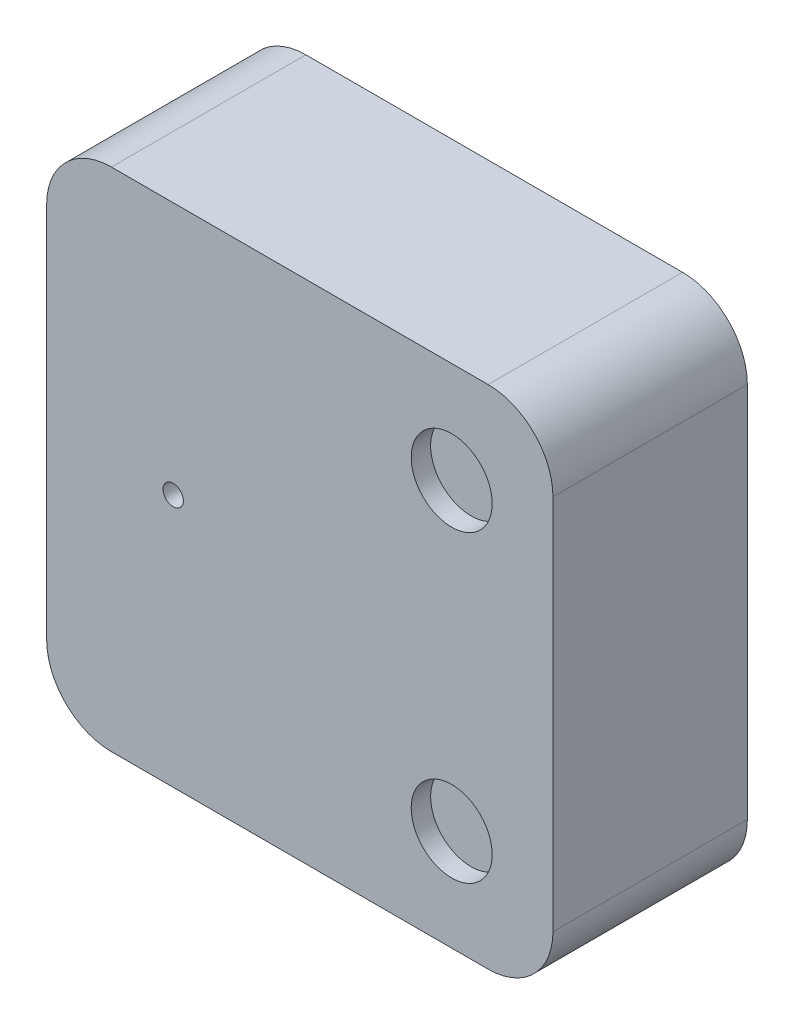
ISO-10303-21;
HEADER;
FILE_DESCRIPTION(('STEP AP214'),'2;1');
FILE_NAME('part.step','',(''),(''),'','','');
FILE_SCHEMA(('AUTOMOTIVE_DESIGN { 1 0 10303 214 1 1 1 1 }'));
ENDSEC;
DATA;
#1=APPLICATION_CONTEXT('core data for automotive mechanical design processes');
#2=APPLICATION_PROTOCOL_DEFINITION('international standard','automotive_design',2000,#1);
#3=PRODUCT_CONTEXT('',#1,'mechanical');
#4=PRODUCT('Part','Part','',(#3));
#5=PRODUCT_RELATED_PRODUCT_CATEGORY('part','',(#4));
#6=PRODUCT_DEFINITION_FORMATION('','',#4);
#7=PRODUCT_DEFINITION_CONTEXT('part definition',#1,'design');
#8=PRODUCT_DEFINITION('design','',#6,#7);
#9=PRODUCT_DEFINITION_SHAPE('','',#8);
#10=(LENGTH_UNIT() NAMED_UNIT(*) SI_UNIT(.MILLI.,.METRE.));
#11=(NAMED_UNIT(*) PLANE_ANGLE_UNIT() SI_UNIT($,.RADIAN.));
#12=(NAMED_UNIT(*) SI_UNIT($,.STERADIAN.) SOLID_ANGLE_UNIT());
#13=UNCERTAINTY_MEASURE_WITH_UNIT(LENGTH_MEASURE(1.E-05),#10,'distance_accuracy_value','');
#14=(GEOMETRIC_REPRESENTATION_CONTEXT(3) GLOBAL_UNCERTAINTY_ASSIGNED_CONTEXT((#13)) GLOBAL_UNIT_ASSIGNED_CONTEXT((#10,
#11,#12)) REPRESENTATION_CONTEXT('',''));
#15=CARTESIAN_POINT('',(0.,0.,0.));
#16=DIRECTION('',(0.,0.,1.));
#17=DIRECTION('',(1.,0.,0.));
#18=AXIS2_PLACEMENT_3D('',#15,#16,#17);
#19=CARTESIAN_POINT('',(125.,-125.,96.));
#20=DIRECTION('',(-1.,0.,0.));
#21=DIRECTION('',(0.,0.,1.));
#22=AXIS2_PLACEMENT_3D('',#19,#20,#21);
#23=PLANE('',#22);
#24=DIRECTION('',(0.,1.,0.));
#25=VECTOR('',#24,1.);
#26=CARTESIAN_POINT('',(125.,-125.,96.));
#27=LINE('',#26,#25);
#28=CARTESIAN_POINT('',(125.,-93.,96.));
#29=VERTEX_POINT('',#28);
#30=CARTESIAN_POINT('',(125.,93.,96.));
#31=VERTEX_POINT('',#30);
#32=EDGE_CURVE('E132',#29,#31,#27,.T.);
#33=ORIENTED_EDGE('',*,*,#32,.F.);
#34=DIRECTION('',(0.,0.,-1.));
#35=VECTOR('',#34,1.);
#36=CARTESIAN_POINT('',(125.,-93.,96.));
#37=LINE('',#36,#35);
#38=CARTESIAN_POINT('',(125.,-93.,0.));
#39=VERTEX_POINT('',#38);
#40=EDGE_CURVE('E11',#29,#39,#37,.T.);
#41=ORIENTED_EDGE('',*,*,#40,.T.);
#42=DIRECTION('',(0.,1.,0.));
#43=VECTOR('',#42,1.);
#44=CARTESIAN_POINT('',(125.,-125.,0.));
#45=LINE('',#44,#43);
#46=CARTESIAN_POINT('',(125.,93.,0.));
#47=VERTEX_POINT('',#46);
#48=EDGE_CURVE('E134',#39,#47,#45,.T.);
#49=ORIENTED_EDGE('',*,*,#48,.T.);
#50=DIRECTION('',(0.,0.,-1.));
#51=VECTOR('',#50,1.);
#52=CARTESIAN_POINT('',(125.,93.,96.));
#53=LINE('',#52,#51);
#54=EDGE_CURVE('E45',#47,#31,#53,.F.);
#55=ORIENTED_EDGE('',*,*,#54,.T.);
#56=EDGE_LOOP('',(#33,#41,#49,#55));
#57=FACE_BOUND('',#56,.T.);
#58=ADVANCED_FACE('F37',(#57),#23,.F.);
#59=CARTESIAN_POINT('',(-125.,125.,96.));
#60=DIRECTION('',(0.,-1.,0.));
#61=DIRECTION('',(0.,0.,-1.));
#62=AXIS2_PLACEMENT_3D('',#59,#60,#61);
#63=PLANE('',#62);
#64=DIRECTION('',(-1.,0.,0.));
#65=VECTOR('',#64,1.);
#66=CARTESIAN_POINT('',(-125.,125.,0.));
#67=LINE('',#66,#65);
#68=CARTESIAN_POINT('',(93.,125.,0.));
#69=VERTEX_POINT('',#68);
#70=CARTESIAN_POINT('',(-93.,125.,0.));
#71=VERTEX_POINT('',#70);
#72=EDGE_CURVE('E130',#69,#71,#67,.T.);
#73=ORIENTED_EDGE('',*,*,#72,.T.);
#74=DIRECTION('',(0.,0.,-1.));
#75=VECTOR('',#74,1.);
#76=CARTESIAN_POINT('',(-93.,125.,96.));
#77=LINE('',#76,#75);
#78=CARTESIAN_POINT('',(-93.,125.,96.));
#79=VERTEX_POINT('',#78);
#80=EDGE_CURVE('E109',#71,#79,#77,.F.);
#81=ORIENTED_EDGE('',*,*,#80,.T.);
#82=DIRECTION('',(-1.,0.,0.));
#83=VECTOR('',#82,1.);
#84=CARTESIAN_POINT('',(-125.,125.,96.));
#85=LINE('',#84,#83);
#86=CARTESIAN_POINT('',(93.,125.,96.));
#87=VERTEX_POINT('',#86);
#88=EDGE_CURVE('E170',#87,#79,#85,.T.);
#89=ORIENTED_EDGE('',*,*,#88,.F.);
#90=DIRECTION('',(0.,0.,-1.));
#91=VECTOR('',#90,1.);
#92=CARTESIAN_POINT('',(93.,125.,96.));
#93=LINE('',#92,#91);
#94=EDGE_CURVE('E114',#87,#69,#93,.T.);
#95=ORIENTED_EDGE('',*,*,#94,.T.);
#96=EDGE_LOOP('',(#73,#81,#89,#95));
#97=FACE_BOUND('',#96,.T.);
#98=ADVANCED_FACE('F174',(#97),#63,.F.);
#99=CARTESIAN_POINT('',(-125.,-125.,96.));
#100=DIRECTION('',(1.,0.,0.));
#101=DIRECTION('',(0.,0.,-1.));
#102=AXIS2_PLACEMENT_3D('',#99,#100,#101);
#103=PLANE('',#102);
#104=DIRECTION('',(0.,-1.,0.));
#105=VECTOR('',#104,1.);
#106=CARTESIAN_POINT('',(-125.,-125.,96.));
#107=LINE('',#106,#105);
#108=CARTESIAN_POINT('',(-125.,93.,96.));
#109=VERTEX_POINT('',#108);
#110=CARTESIAN_POINT('',(-125.,-93.,96.));
#111=VERTEX_POINT('',#110);
#112=EDGE_CURVE('E123',#109,#111,#107,.T.);
#113=ORIENTED_EDGE('',*,*,#112,.F.);
#114=DIRECTION('',(0.,0.,-1.));
#115=VECTOR('',#114,1.);
#116=CARTESIAN_POINT('',(-125.,93.,96.));
#117=LINE('',#116,#115);
#118=CARTESIAN_POINT('',(-125.,93.,0.));
#119=VERTEX_POINT('',#118);
#120=EDGE_CURVE('E108',#109,#119,#117,.T.);
#121=ORIENTED_EDGE('',*,*,#120,.T.);
#122=DIRECTION('',(0.,-1.,0.));
#123=VECTOR('',#122,1.);
#124=CARTESIAN_POINT('',(-125.,-125.,0.));
#125=LINE('',#124,#123);
#126=CARTESIAN_POINT('',(-125.,-93.,0.));
#127=VERTEX_POINT('',#126);
#128=EDGE_CURVE('E121',#119,#127,#125,.T.);
#129=ORIENTED_EDGE('',*,*,#128,.T.);
#130=DIRECTION('',(0.,0.,-1.));
#131=VECTOR('',#130,1.);
#132=CARTESIAN_POINT('',(-125.,-93.,96.));
#133=LINE('',#132,#131);
#134=EDGE_CURVE('E125',#127,#111,#133,.F.);
#135=ORIENTED_EDGE('',*,*,#134,.T.);
#136=EDGE_LOOP('',(#113,#121,#129,#135));
#137=FACE_BOUND('',#136,.T.);
#138=ADVANCED_FACE('F120',(#137),#103,.F.);
#139=CARTESIAN_POINT('',(-125.,-125.,96.));
#140=DIRECTION('',(0.,1.,0.));
#141=DIRECTION('',(0.,0.,1.));
#142=AXIS2_PLACEMENT_3D('',#139,#140,#141);
#143=PLANE('',#142);
#144=DIRECTION('',(1.,0.,0.));
#145=VECTOR('',#144,1.);
#146=CARTESIAN_POINT('',(-125.,-125.,96.));
#147=LINE('',#146,#145);
#148=CARTESIAN_POINT('',(-93.,-125.,96.));
#149=VERTEX_POINT('',#148);
#150=CARTESIAN_POINT('',(93.,-125.,96.));
#151=VERTEX_POINT('',#150);
#152=EDGE_CURVE('E138',#149,#151,#147,.T.);
#153=ORIENTED_EDGE('',*,*,#152,.F.);
#154=DIRECTION('',(0.,0.,-1.));
#155=VECTOR('',#154,1.);
#156=CARTESIAN_POINT('',(-93.,-125.,96.));
#157=LINE('',#156,#155);
#158=CARTESIAN_POINT('',(-93.,-125.,0.));
#159=VERTEX_POINT('',#158);
#160=EDGE_CURVE('E155',#149,#159,#157,.T.);
#161=ORIENTED_EDGE('',*,*,#160,.T.);
#162=DIRECTION('',(1.,0.,0.));
#163=VECTOR('',#162,1.);
#164=CARTESIAN_POINT('',(-125.,-125.,0.));
#165=LINE('',#164,#163);
#166=CARTESIAN_POINT('',(93.,-125.,0.));
#167=VERTEX_POINT('',#166);
#168=EDGE_CURVE('E129',#159,#167,#165,.T.);
#169=ORIENTED_EDGE('',*,*,#168,.T.);
#170=DIRECTION('',(0.,0.,-1.));
#171=VECTOR('',#170,1.);
#172=CARTESIAN_POINT('',(93.,-125.,96.));
#173=LINE('',#172,#171);
#174=EDGE_CURVE('E52',#167,#151,#173,.F.);
#175=ORIENTED_EDGE('',*,*,#174,.T.);
#176=EDGE_LOOP('',(#153,#161,#169,#175));
#177=FACE_BOUND('',#176,.T.);
#178=ADVANCED_FACE('F202',(#177),#143,.F.);
#179=CARTESIAN_POINT('',(0.,0.,96.));
#180=DIRECTION('',(0.,0.,-1.));
#181=DIRECTION('',(-1.,0.,0.));
#182=AXIS2_PLACEMENT_3D('',#179,#180,#181);
#183=PLANE('',#182);
#184=CARTESIAN_POINT('',(75.,75.,96.));
#185=DIRECTION('',(0.,0.,1.));
#186=DIRECTION('',(1.,0.,0.));
#187=AXIS2_PLACEMENT_3D('',#184,#185,#186);
#188=CIRCLE('',#187,20.);
#189=CARTESIAN_POINT('',(95.,75.,96.));
#190=VERTEX_POINT('',#189);
#191=EDGE_CURVE('E177',#190,#190,#188,.T.);
#192=ORIENTED_EDGE('',*,*,#191,.F.);
#193=EDGE_LOOP('',(#192));
#194=FACE_BOUND('',#193,.T.);
#195=CARTESIAN_POINT('',(75.,-75.,96.));
#196=DIRECTION('',(0.,0.,1.));
#197=DIRECTION('',(-1.,0.,0.));
#198=AXIS2_PLACEMENT_3D('',#195,#196,#197);
#199=CIRCLE('',#198,20.);
#200=CARTESIAN_POINT('',(55.,-75.,96.));
#201=VERTEX_POINT('',#200);
#202=EDGE_CURVE('E189',#201,#201,#199,.T.);
#203=ORIENTED_EDGE('',*,*,#202,.F.);
#204=EDGE_LOOP('',(#203));
#205=FACE_BOUND('',#204,.T.);
#206=CARTESIAN_POINT('',(-62.5,0.,96.));
#207=DIRECTION('',(0.,0.,1.));
#208=DIRECTION('',(1.,0.,0.));
#209=AXIS2_PLACEMENT_3D('',#206,#207,#208);
#210=CIRCLE('',#209,5.);
#211=CARTESIAN_POINT('',(-57.5,0.,96.));
#212=VERTEX_POINT('',#211);
#213=EDGE_CURVE('E183',#212,#212,#210,.T.);
#214=ORIENTED_EDGE('',*,*,#213,.F.);
#215=EDGE_LOOP('',(#214));
#216=FACE_BOUND('',#215,.T.);
#217=ORIENTED_EDGE('',*,*,#88,.T.);
#218=CARTESIAN_POINT('',(-93.,93.,96.));
#219=DIRECTION('',(0.,0.,-1.));
#220=DIRECTION('',(-1.,0.,0.));
#221=AXIS2_PLACEMENT_3D('',#218,#219,#220);
#222=CIRCLE('',#221,32.);
#223=EDGE_CURVE('E152',#79,#109,#222,.F.);
#224=ORIENTED_EDGE('',*,*,#223,.T.);
#225=ORIENTED_EDGE('',*,*,#112,.T.);
#226=CARTESIAN_POINT('',(-93.,-93.,96.));
#227=DIRECTION('',(0.,0.,-1.));
#228=DIRECTION('',(-1.,0.,0.));
#229=AXIS2_PLACEMENT_3D('',#226,#227,#228);
#230=CIRCLE('',#229,32.);
#231=EDGE_CURVE('E59',#111,#149,#230,.F.);
#232=ORIENTED_EDGE('',*,*,#231,.T.);
#233=ORIENTED_EDGE('',*,*,#152,.T.);
#234=CARTESIAN_POINT('',(93.,-93.,96.));
#235=DIRECTION('',(0.,0.,-1.));
#236=DIRECTION('',(-1.,0.,0.));
#237=AXIS2_PLACEMENT_3D('',#234,#235,#236);
#238=CIRCLE('',#237,32.);
#239=EDGE_CURVE('E149',#151,#29,#238,.F.);
#240=ORIENTED_EDGE('',*,*,#239,.T.);
#241=ORIENTED_EDGE('',*,*,#32,.T.);
#242=CARTESIAN_POINT('',(93.,93.,96.));
#243=DIRECTION('',(0.,0.,-1.));
#244=DIRECTION('',(-1.,0.,0.));
#245=AXIS2_PLACEMENT_3D('',#242,#243,#244);
#246=CIRCLE('',#245,32.);
#247=EDGE_CURVE('E147',#31,#87,#246,.F.);
#248=ORIENTED_EDGE('',*,*,#247,.T.);
#249=EDGE_LOOP('',(#217,#224,#225,#232,#233,#240,#241,#248));
#250=FACE_BOUND('',#249,.T.);
#251=ADVANCED_FACE('F167',(#194,#205,#216,#250),#183,.F.);
#252=CARTESIAN_POINT('',(0.,0.,0.));
#253=DIRECTION('',(0.,0.,-1.));
#254=DIRECTION('',(-1.,0.,0.));
#255=AXIS2_PLACEMENT_3D('',#252,#253,#254);
#256=PLANE('',#255);
#257=ORIENTED_EDGE('',*,*,#128,.F.);
#258=CARTESIAN_POINT('',(-93.,93.,0.));
#259=DIRECTION('',(0.,0.,-1.));
#260=DIRECTION('',(-1.,0.,0.));
#261=AXIS2_PLACEMENT_3D('',#258,#259,#260);
#262=CIRCLE('',#261,32.);
#263=EDGE_CURVE('E104',#119,#71,#262,.T.);
#264=ORIENTED_EDGE('',*,*,#263,.T.);
#265=ORIENTED_EDGE('',*,*,#72,.F.);
#266=CARTESIAN_POINT('',(93.,93.,0.));
#267=DIRECTION('',(0.,0.,-1.));
#268=DIRECTION('',(-1.,0.,0.));
#269=AXIS2_PLACEMENT_3D('',#266,#267,#268);
#270=CIRCLE('',#269,32.);
#271=EDGE_CURVE('E124',#69,#47,#270,.T.);
#272=ORIENTED_EDGE('',*,*,#271,.T.);
#273=ORIENTED_EDGE('',*,*,#48,.F.);
#274=CARTESIAN_POINT('',(93.,-93.,0.));
#275=DIRECTION('',(0.,0.,-1.));
#276=DIRECTION('',(-1.,0.,0.));
#277=AXIS2_PLACEMENT_3D('',#274,#275,#276);
#278=CIRCLE('',#277,32.);
#279=EDGE_CURVE('E141',#39,#167,#278,.T.);
#280=ORIENTED_EDGE('',*,*,#279,.T.);
#281=ORIENTED_EDGE('',*,*,#168,.F.);
#282=CARTESIAN_POINT('',(-93.,-93.,0.));
#283=DIRECTION('',(0.,0.,-1.));
#284=DIRECTION('',(-1.,0.,0.));
#285=AXIS2_PLACEMENT_3D('',#282,#283,#284);
#286=CIRCLE('',#285,32.);
#287=EDGE_CURVE('E115',#159,#127,#286,.T.);
#288=ORIENTED_EDGE('',*,*,#287,.T.);
#289=EDGE_LOOP('',(#257,#264,#265,#272,#273,#280,#281,#288));
#290=FACE_BOUND('',#289,.T.);
#291=ADVANCED_FACE('F127',(#290),#256,.T.);
#292=CARTESIAN_POINT('',(-93.,93.,96.));
#293=DIRECTION('',(0.,0.,-1.));
#294=DIRECTION('',(-1.,0.,0.));
#295=AXIS2_PLACEMENT_3D('',#292,#293,#294);
#296=CYLINDRICAL_SURFACE('',#295,32.);
#297=ORIENTED_EDGE('',*,*,#223,.F.);
#298=ORIENTED_EDGE('',*,*,#80,.F.);
#299=ORIENTED_EDGE('',*,*,#263,.F.);
#300=ORIENTED_EDGE('',*,*,#120,.F.);
#301=EDGE_LOOP('',(#297,#298,#299,#300));
#302=FACE_BOUND('',#301,.T.);
#303=ADVANCED_FACE('F107',(#302),#296,.T.);
#304=CARTESIAN_POINT('',(-93.,-93.,96.));
#305=DIRECTION('',(0.,0.,-1.));
#306=DIRECTION('',(-1.,0.,0.));
#307=AXIS2_PLACEMENT_3D('',#304,#305,#306);
#308=CYLINDRICAL_SURFACE('',#307,32.);
#309=ORIENTED_EDGE('',*,*,#231,.F.);
#310=ORIENTED_EDGE('',*,*,#134,.F.);
#311=ORIENTED_EDGE('',*,*,#287,.F.);
#312=ORIENTED_EDGE('',*,*,#160,.F.);
#313=EDGE_LOOP('',(#309,#310,#311,#312));
#314=FACE_BOUND('',#313,.T.);
#315=ADVANCED_FACE('F232',(#314),#308,.T.);
#316=CARTESIAN_POINT('',(93.,-93.,96.));
#317=DIRECTION('',(0.,0.,-1.));
#318=DIRECTION('',(-1.,0.,0.));
#319=AXIS2_PLACEMENT_3D('',#316,#317,#318);
#320=CYLINDRICAL_SURFACE('',#319,32.);
#321=ORIENTED_EDGE('',*,*,#239,.F.);
#322=ORIENTED_EDGE('',*,*,#174,.F.);
#323=ORIENTED_EDGE('',*,*,#279,.F.);
#324=ORIENTED_EDGE('',*,*,#40,.F.);
#325=EDGE_LOOP('',(#321,#322,#323,#324));
#326=FACE_BOUND('',#325,.T.);
#327=ADVANCED_FACE('F220',(#326),#320,.T.);
#328=CARTESIAN_POINT('',(93.,93.,96.));
#329=DIRECTION('',(0.,0.,-1.));
#330=DIRECTION('',(-1.,0.,0.));
#331=AXIS2_PLACEMENT_3D('',#328,#329,#330);
#332=CYLINDRICAL_SURFACE('',#331,32.);
#333=ORIENTED_EDGE('',*,*,#247,.F.);
#334=ORIENTED_EDGE('',*,*,#54,.F.);
#335=ORIENTED_EDGE('',*,*,#271,.F.);
#336=ORIENTED_EDGE('',*,*,#94,.F.);
#337=EDGE_LOOP('',(#333,#334,#335,#336));
#338=FACE_BOUND('',#337,.T.);
#339=ADVANCED_FACE('F39',(#338),#332,.T.);
#340=CARTESIAN_POINT('',(-62.5,0.,86.4));
#341=DIRECTION('',(0.,0.,1.));
#342=DIRECTION('',(1.,0.,0.));
#343=AXIS2_PLACEMENT_3D('',#340,#341,#342);
#344=CYLINDRICAL_SURFACE('',#343,5.);
#345=CARTESIAN_POINT('',(-62.5,0.,86.4));
#346=DIRECTION('',(0.,0.,1.));
#347=DIRECTION('',(1.,0.,0.));
#348=AXIS2_PLACEMENT_3D('',#345,#346,#347);
#349=CIRCLE('',#348,5.);
#350=CARTESIAN_POINT('',(-57.5,0.,86.4));
#351=VERTEX_POINT('',#350);
#352=EDGE_CURVE('E186',#351,#351,#349,.T.);
#353=ORIENTED_EDGE('',*,*,#352,.F.);
#354=EDGE_LOOP('',(#353));
#355=FACE_BOUND('',#354,.T.);
#356=ORIENTED_EDGE('',*,*,#213,.T.);
#357=EDGE_LOOP('',(#356));
#358=FACE_BOUND('',#357,.T.);
#359=ADVANCED_FACE('F208',(#355,#358),#344,.F.);
#360=CARTESIAN_POINT('',(-62.5,0.,86.4));
#361=DIRECTION('',(0.,0.,1.));
#362=DIRECTION('',(1.,0.,0.));
#363=AXIS2_PLACEMENT_3D('',#360,#361,#362);
#364=PLANE('',#363);
#365=ORIENTED_EDGE('',*,*,#352,.T.);
#366=EDGE_LOOP('',(#365));
#367=FACE_BOUND('',#366,.T.);
#368=ADVANCED_FACE('F210',(#367),#364,.T.);
#369=CARTESIAN_POINT('',(75.,-75.,86.4));
#370=DIRECTION('',(0.,0.,1.));
#371=DIRECTION('',(1.,0.,0.));
#372=AXIS2_PLACEMENT_3D('',#369,#370,#371);
#373=CYLINDRICAL_SURFACE('',#372,20.);
#374=CARTESIAN_POINT('',(75.,-75.,86.4));
#375=DIRECTION('',(0.,0.,1.));
#376=DIRECTION('',(-1.,0.,0.));
#377=AXIS2_PLACEMENT_3D('',#374,#375,#376);
#378=CIRCLE('',#377,20.);
#379=CARTESIAN_POINT('',(55.,-75.,86.4));
#380=VERTEX_POINT('',#379);
#381=EDGE_CURVE('E192',#380,#380,#378,.T.);
#382=ORIENTED_EDGE('',*,*,#381,.F.);
#383=EDGE_LOOP('',(#382));
#384=FACE_BOUND('',#383,.T.);
#385=ORIENTED_EDGE('',*,*,#202,.T.);
#386=EDGE_LOOP('',(#385));
#387=FACE_BOUND('',#386,.T.);
#388=ADVANCED_FACE('F217',(#384,#387),#373,.F.);
#389=CARTESIAN_POINT('',(75.,-75.,86.4));
#390=DIRECTION('',(0.,0.,-1.));
#391=DIRECTION('',(-1.,0.,0.));
#392=AXIS2_PLACEMENT_3D('',#389,#390,#391);
#393=PLANE('',#392);
#394=ORIENTED_EDGE('',*,*,#381,.T.);
#395=EDGE_LOOP('',(#394));
#396=FACE_BOUND('',#395,.T.);
#397=ADVANCED_FACE('F274',(#396),#393,.F.);
#398=CARTESIAN_POINT('',(75.,75.,86.4));
#399=DIRECTION('',(0.,0.,1.));
#400=DIRECTION('',(1.,0.,0.));
#401=AXIS2_PLACEMENT_3D('',#398,#399,#400);
#402=CYLINDRICAL_SURFACE('',#401,20.);
#403=CARTESIAN_POINT('',(75.,75.,86.4));
#404=DIRECTION('',(0.,0.,1.));
#405=DIRECTION('',(1.,0.,0.));
#406=AXIS2_PLACEMENT_3D('',#403,#404,#405);
#407=CIRCLE('',#406,20.);
#408=CARTESIAN_POINT('',(95.,75.,86.4));
#409=VERTEX_POINT('',#408);
#410=EDGE_CURVE('E175',#409,#409,#407,.T.);
#411=ORIENTED_EDGE('',*,*,#410,.F.);
#412=EDGE_LOOP('',(#411));
#413=FACE_BOUND('',#412,.T.);
#414=ORIENTED_EDGE('',*,*,#191,.T.);
#415=EDGE_LOOP('',(#414));
#416=FACE_BOUND('',#415,.T.);
#417=ADVANCED_FACE('F198',(#413,#416),#402,.F.);
#418=CARTESIAN_POINT('',(75.,75.,86.4));
#419=DIRECTION('',(0.,0.,1.));
#420=DIRECTION('',(1.,0.,0.));
#421=AXIS2_PLACEMENT_3D('',#418,#419,#420);
#422=PLANE('',#421);
#423=ORIENTED_EDGE('',*,*,#410,.T.);
#424=EDGE_LOOP('',(#423));
#425=FACE_BOUND('',#424,.T.);
#426=ADVANCED_FACE('F293',(#425),#422,.T.);
#427=CLOSED_SHELL('',(#58,#98,#138,#178,#251,#291,#303,#315,#327,#339,#359,#368,#388,#397,#417,#426));
#428=MANIFOLD_SOLID_BREP('B2',#427);
#429=ADVANCED_BREP_SHAPE_REPRESENTATION('',(#18,#428),#14);
#430=SHAPE_DEFINITION_REPRESENTATION(#9,#429);
ENDSEC;
END-ISO-10303-21;
